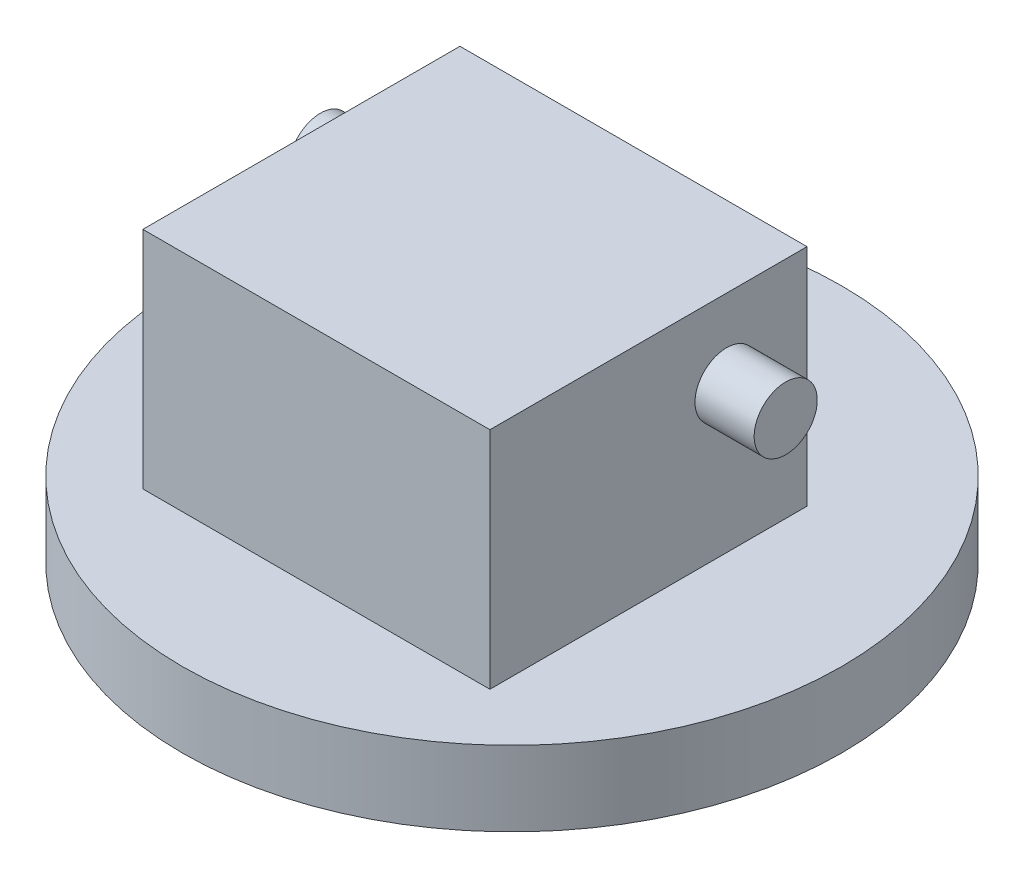
ISO-10303-21;
HEADER;
FILE_DESCRIPTION(('STEP AP214'),'2;1');
FILE_NAME('part.step','',(''),(''),'','','');
FILE_SCHEMA(('AUTOMOTIVE_DESIGN { 1 0 10303 214 1 1 1 1 }'));
ENDSEC;
DATA;
#1=APPLICATION_CONTEXT('core data for automotive mechanical design processes');
#2=APPLICATION_PROTOCOL_DEFINITION('international standard','automotive_design',2000,#1);
#3=PRODUCT_CONTEXT('',#1,'mechanical');
#4=PRODUCT('Part','Part','',(#3));
#5=PRODUCT_RELATED_PRODUCT_CATEGORY('part','',(#4));
#6=PRODUCT_DEFINITION_FORMATION('','',#4);
#7=PRODUCT_DEFINITION_CONTEXT('part definition',#1,'design');
#8=PRODUCT_DEFINITION('design','',#6,#7);
#9=PRODUCT_DEFINITION_SHAPE('','',#8);
#10=(LENGTH_UNIT() NAMED_UNIT(*) SI_UNIT(.MILLI.,.METRE.));
#11=(NAMED_UNIT(*) PLANE_ANGLE_UNIT() SI_UNIT($,.RADIAN.));
#12=(NAMED_UNIT(*) SI_UNIT($,.STERADIAN.) SOLID_ANGLE_UNIT());
#13=UNCERTAINTY_MEASURE_WITH_UNIT(LENGTH_MEASURE(1.E-05),#10,'distance_accuracy_value','');
#14=(GEOMETRIC_REPRESENTATION_CONTEXT(3) GLOBAL_UNCERTAINTY_ASSIGNED_CONTEXT((#13)) GLOBAL_UNIT_ASSIGNED_CONTEXT((#10,
#11,#12)) REPRESENTATION_CONTEXT('',''));
#15=CARTESIAN_POINT('',(0.,0.,0.));
#16=DIRECTION('',(0.,0.,1.));
#17=DIRECTION('',(1.,0.,0.));
#18=AXIS2_PLACEMENT_3D('',#15,#16,#17);
#19=CARTESIAN_POINT('',(0.,9.5,0.));
#20=DIRECTION('',(0.,1.,0.));
#21=DIRECTION('',(0.,0.,1.));
#22=AXIS2_PLACEMENT_3D('',#19,#20,#21);
#23=PLANE('',#22);
#24=CARTESIAN_POINT('',(0.,9.5,0.));
#25=DIRECTION('',(0.,1.,0.));
#26=DIRECTION('',(0.,0.,1.));
#27=AXIS2_PLACEMENT_3D('',#24,#25,#26);
#28=CIRCLE('',#27,41.8);
#29=CARTESIAN_POINT('',(0.,9.5,41.8));
#30=VERTEX_POINT('',#29);
#31=EDGE_CURVE('E11',#30,#30,#28,.T.);
#32=ORIENTED_EDGE('',*,*,#31,.T.);
#33=EDGE_LOOP('',(#32));
#34=FACE_BOUND('',#33,.T.);
#35=DIRECTION('',(1.,0.,0.));
#36=VECTOR('',#35,1.);
#37=CARTESIAN_POINT('',(0.,9.5,-15.4));
#38=LINE('',#37,#36);
#39=CARTESIAN_POINT('',(-22.,9.5,-15.4));
#40=VERTEX_POINT('',#39);
#41=CARTESIAN_POINT('',(22.,9.5,-15.4));
#42=VERTEX_POINT('',#41);
#43=EDGE_CURVE('E95',#40,#42,#38,.T.);
#44=ORIENTED_EDGE('',*,*,#43,.T.);
#45=DIRECTION('',(0.,0.,1.));
#46=VECTOR('',#45,1.);
#47=CARTESIAN_POINT('',(22.,9.5,0.));
#48=LINE('',#47,#46);
#49=CARTESIAN_POINT('',(22.,9.5,24.8));
#50=VERTEX_POINT('',#49);
#51=EDGE_CURVE('E60',#42,#50,#48,.T.);
#52=ORIENTED_EDGE('',*,*,#51,.T.);
#53=DIRECTION('',(-1.,0.,0.));
#54=VECTOR('',#53,1.);
#55=CARTESIAN_POINT('',(0.,9.5,24.8));
#56=LINE('',#55,#54);
#57=CARTESIAN_POINT('',(-22.,9.5,24.8));
#58=VERTEX_POINT('',#57);
#59=EDGE_CURVE('E111',#50,#58,#56,.T.);
#60=ORIENTED_EDGE('',*,*,#59,.T.);
#61=DIRECTION('',(0.,0.,1.));
#62=VECTOR('',#61,1.);
#63=CARTESIAN_POINT('',(-22.,9.5,0.));
#64=LINE('',#63,#62);
#65=EDGE_CURVE('E119',#40,#58,#64,.T.);
#66=ORIENTED_EDGE('',*,*,#65,.F.);
#67=EDGE_LOOP('',(#44,#52,#60,#66));
#68=FACE_BOUND('',#67,.T.);
#69=ADVANCED_FACE('F45',(#34,#68),#23,.T.);
#70=CARTESIAN_POINT('',(0.,9.5,0.));
#71=DIRECTION('',(0.,-1.,0.));
#72=DIRECTION('',(0.,0.,-1.));
#73=AXIS2_PLACEMENT_3D('',#70,#71,#72);
#74=CYLINDRICAL_SURFACE('',#73,41.8);
#75=ORIENTED_EDGE('',*,*,#31,.F.);
#76=EDGE_LOOP('',(#75));
#77=FACE_BOUND('',#76,.T.);
#78=CARTESIAN_POINT('',(0.,0.,0.));
#79=DIRECTION('',(0.,1.,0.));
#80=DIRECTION('',(0.,0.,1.));
#81=AXIS2_PLACEMENT_3D('',#78,#79,#80);
#82=CIRCLE('',#81,41.8);
#83=CARTESIAN_POINT('',(0.,0.,41.8));
#84=VERTEX_POINT('',#83);
#85=EDGE_CURVE('E49',#84,#84,#82,.T.);
#86=ORIENTED_EDGE('',*,*,#85,.T.);
#87=EDGE_LOOP('',(#86));
#88=FACE_BOUND('',#87,.T.);
#89=ADVANCED_FACE('F47',(#77,#88),#74,.T.);
#90=CARTESIAN_POINT('',(0.,0.,0.));
#91=DIRECTION('',(0.,1.,0.));
#92=DIRECTION('',(0.,0.,1.));
#93=AXIS2_PLACEMENT_3D('',#90,#91,#92);
#94=PLANE('',#93);
#95=ORIENTED_EDGE('',*,*,#85,.F.);
#96=EDGE_LOOP('',(#95));
#97=FACE_BOUND('',#96,.T.);
#98=ADVANCED_FACE('F129',(#97),#94,.F.);
#99=CARTESIAN_POINT('',(22.,38.,0.));
#100=DIRECTION('',(1.,0.,0.));
#101=DIRECTION('',(0.,0.,-1.));
#102=AXIS2_PLACEMENT_3D('',#99,#100,#101);
#103=PLANE('',#102);
#104=CARTESIAN_POINT('',(22.,28.,-5.20000000000001));
#105=DIRECTION('',(1.,0.,0.));
#106=DIRECTION('',(0.,0.,-1.));
#107=AXIS2_PLACEMENT_3D('',#104,#105,#106);
#108=CIRCLE('',#107,4.);
#109=CARTESIAN_POINT('',(22.,28.,-9.20000000000001));
#110=VERTEX_POINT('',#109);
#111=EDGE_CURVE('E176',#110,#110,#108,.T.);
#112=ORIENTED_EDGE('',*,*,#111,.F.);
#113=EDGE_LOOP('',(#112));
#114=FACE_BOUND('',#113,.T.);
#115=ORIENTED_EDGE('',*,*,#51,.F.);
#116=DIRECTION('',(0.,-1.,0.));
#117=VECTOR('',#116,1.);
#118=CARTESIAN_POINT('',(22.,38.,-15.4));
#119=LINE('',#118,#117);
#120=CARTESIAN_POINT('',(22.,38.,-15.4));
#121=VERTEX_POINT('',#120);
#122=EDGE_CURVE('E83',#121,#42,#119,.T.);
#123=ORIENTED_EDGE('',*,*,#122,.F.);
#124=DIRECTION('',(0.,0.,1.));
#125=VECTOR('',#124,1.);
#126=CARTESIAN_POINT('',(22.,38.,0.));
#127=LINE('',#126,#125);
#128=CARTESIAN_POINT('',(22.,38.,24.8));
#129=VERTEX_POINT('',#128);
#130=EDGE_CURVE('E109',#121,#129,#127,.T.);
#131=ORIENTED_EDGE('',*,*,#130,.T.);
#132=DIRECTION('',(0.,-1.,0.));
#133=VECTOR('',#132,1.);
#134=CARTESIAN_POINT('',(22.,38.,24.8));
#135=LINE('',#134,#133);
#136=EDGE_CURVE('E68',#129,#50,#135,.T.);
#137=ORIENTED_EDGE('',*,*,#136,.T.);
#138=EDGE_LOOP('',(#115,#123,#131,#137));
#139=FACE_BOUND('',#138,.T.);
#140=ADVANCED_FACE('F131',(#114,#139),#103,.T.);
#141=CARTESIAN_POINT('',(0.,38.,-15.4));
#142=DIRECTION('',(0.,0.,-1.));
#143=DIRECTION('',(-1.,0.,0.));
#144=AXIS2_PLACEMENT_3D('',#141,#142,#143);
#145=PLANE('',#144);
#146=ORIENTED_EDGE('',*,*,#43,.F.);
#147=DIRECTION('',(0.,-1.,0.));
#148=VECTOR('',#147,1.);
#149=CARTESIAN_POINT('',(-22.,38.,-15.4));
#150=LINE('',#149,#148);
#151=CARTESIAN_POINT('',(-22.,38.,-15.4));
#152=VERTEX_POINT('',#151);
#153=EDGE_CURVE('E89',#152,#40,#150,.T.);
#154=ORIENTED_EDGE('',*,*,#153,.F.);
#155=DIRECTION('',(1.,0.,0.));
#156=VECTOR('',#155,1.);
#157=CARTESIAN_POINT('',(0.,38.,-15.4));
#158=LINE('',#157,#156);
#159=EDGE_CURVE('E93',#152,#121,#158,.T.);
#160=ORIENTED_EDGE('',*,*,#159,.T.);
#161=ORIENTED_EDGE('',*,*,#122,.T.);
#162=EDGE_LOOP('',(#146,#154,#160,#161));
#163=FACE_BOUND('',#162,.T.);
#164=ADVANCED_FACE('F91',(#163),#145,.T.);
#165=CARTESIAN_POINT('',(-22.,38.,0.));
#166=DIRECTION('',(1.,0.,0.));
#167=DIRECTION('',(0.,0.,-1.));
#168=AXIS2_PLACEMENT_3D('',#165,#166,#167);
#169=PLANE('',#168);
#170=CARTESIAN_POINT('',(-22.,28.,-5.20000000000001));
#171=DIRECTION('',(1.,0.,0.));
#172=DIRECTION('',(0.,0.,-1.));
#173=AXIS2_PLACEMENT_3D('',#170,#171,#172);
#174=CIRCLE('',#173,4.);
#175=CARTESIAN_POINT('',(-22.,28.,-9.20000000000001));
#176=VERTEX_POINT('',#175);
#177=EDGE_CURVE('E177',#176,#176,#174,.T.);
#178=ORIENTED_EDGE('',*,*,#177,.T.);
#179=EDGE_LOOP('',(#178));
#180=FACE_BOUND('',#179,.T.);
#181=ORIENTED_EDGE('',*,*,#65,.T.);
#182=DIRECTION('',(0.,-1.,0.));
#183=VECTOR('',#182,1.);
#184=CARTESIAN_POINT('',(-22.,38.,24.8));
#185=LINE('',#184,#183);
#186=CARTESIAN_POINT('',(-22.,38.,24.8));
#187=VERTEX_POINT('',#186);
#188=EDGE_CURVE('E99',#187,#58,#185,.T.);
#189=ORIENTED_EDGE('',*,*,#188,.F.);
#190=DIRECTION('',(0.,0.,1.));
#191=VECTOR('',#190,1.);
#192=CARTESIAN_POINT('',(-22.,38.,0.));
#193=LINE('',#192,#191);
#194=EDGE_CURVE('E102',#152,#187,#193,.T.);
#195=ORIENTED_EDGE('',*,*,#194,.F.);
#196=ORIENTED_EDGE('',*,*,#153,.T.);
#197=EDGE_LOOP('',(#181,#189,#195,#196));
#198=FACE_BOUND('',#197,.T.);
#199=ADVANCED_FACE('F103',(#180,#198),#169,.F.);
#200=CARTESIAN_POINT('',(0.,38.,24.8));
#201=DIRECTION('',(0.,0.,1.));
#202=DIRECTION('',(1.,0.,0.));
#203=AXIS2_PLACEMENT_3D('',#200,#201,#202);
#204=PLANE('',#203);
#205=ORIENTED_EDGE('',*,*,#59,.F.);
#206=ORIENTED_EDGE('',*,*,#136,.F.);
#207=DIRECTION('',(-1.,0.,0.));
#208=VECTOR('',#207,1.);
#209=CARTESIAN_POINT('',(0.,38.,24.8));
#210=LINE('',#209,#208);
#211=EDGE_CURVE('E106',#129,#187,#210,.T.);
#212=ORIENTED_EDGE('',*,*,#211,.T.);
#213=ORIENTED_EDGE('',*,*,#188,.T.);
#214=EDGE_LOOP('',(#205,#206,#212,#213));
#215=FACE_BOUND('',#214,.T.);
#216=ADVANCED_FACE('F150',(#215),#204,.T.);
#217=CARTESIAN_POINT('',(0.,38.,0.));
#218=DIRECTION('',(0.,1.,0.));
#219=DIRECTION('',(0.,0.,1.));
#220=AXIS2_PLACEMENT_3D('',#217,#218,#219);
#221=PLANE('',#220);
#222=ORIENTED_EDGE('',*,*,#130,.F.);
#223=ORIENTED_EDGE('',*,*,#159,.F.);
#224=ORIENTED_EDGE('',*,*,#194,.T.);
#225=ORIENTED_EDGE('',*,*,#211,.F.);
#226=EDGE_LOOP('',(#222,#223,#224,#225));
#227=FACE_BOUND('',#226,.T.);
#228=ADVANCED_FACE('F108',(#227),#221,.T.);
#229=CARTESIAN_POINT('',(29.5,28.,-5.20000000000001));
#230=DIRECTION('',(-1.,0.,0.));
#231=DIRECTION('',(0.,0.,1.));
#232=AXIS2_PLACEMENT_3D('',#229,#230,#231);
#233=CYLINDRICAL_SURFACE('',#232,4.);
#234=CARTESIAN_POINT('',(29.5,28.,-5.20000000000001));
#235=DIRECTION('',(1.,0.,0.));
#236=DIRECTION('',(0.,0.,-1.));
#237=AXIS2_PLACEMENT_3D('',#234,#235,#236);
#238=CIRCLE('',#237,4.);
#239=CARTESIAN_POINT('',(29.5,28.,-9.20000000000001));
#240=VERTEX_POINT('',#239);
#241=EDGE_CURVE('E117',#240,#240,#238,.T.);
#242=ORIENTED_EDGE('',*,*,#241,.F.);
#243=EDGE_LOOP('',(#242));
#244=FACE_BOUND('',#243,.T.);
#245=ORIENTED_EDGE('',*,*,#111,.T.);
#246=EDGE_LOOP('',(#245));
#247=FACE_BOUND('',#246,.T.);
#248=ADVANCED_FACE('F156',(#244,#247),#233,.T.);
#249=CARTESIAN_POINT('',(29.5,28.,-5.20000000000001));
#250=DIRECTION('',(1.,0.,0.));
#251=DIRECTION('',(0.,0.,-1.));
#252=AXIS2_PLACEMENT_3D('',#249,#250,#251);
#253=PLANE('',#252);
#254=ORIENTED_EDGE('',*,*,#241,.T.);
#255=EDGE_LOOP('',(#254));
#256=FACE_BOUND('',#255,.T.);
#257=ADVANCED_FACE('F159',(#256),#253,.T.);
#258=CARTESIAN_POINT('',(-29.5,28.,-5.20000000000001));
#259=DIRECTION('',(1.,0.,0.));
#260=DIRECTION('',(0.,0.,-1.));
#261=AXIS2_PLACEMENT_3D('',#258,#259,#260);
#262=CYLINDRICAL_SURFACE('',#261,4.);
#263=CARTESIAN_POINT('',(-29.5,28.,-5.20000000000001));
#264=DIRECTION('',(1.,0.,0.));
#265=DIRECTION('',(0.,0.,-1.));
#266=AXIS2_PLACEMENT_3D('',#263,#264,#265);
#267=CIRCLE('',#266,4.);
#268=CARTESIAN_POINT('',(-29.5,28.,-9.20000000000001));
#269=VERTEX_POINT('',#268);
#270=EDGE_CURVE('E175',#269,#269,#267,.T.);
#271=ORIENTED_EDGE('',*,*,#270,.T.);
#272=EDGE_LOOP('',(#271));
#273=FACE_BOUND('',#272,.T.);
#274=ORIENTED_EDGE('',*,*,#177,.F.);
#275=EDGE_LOOP('',(#274));
#276=FACE_BOUND('',#275,.T.);
#277=ADVANCED_FACE('F163',(#273,#276),#262,.T.);
#278=CARTESIAN_POINT('',(-29.5,28.,-5.20000000000001));
#279=DIRECTION('',(-1.,0.,0.));
#280=DIRECTION('',(0.,0.,-1.));
#281=AXIS2_PLACEMENT_3D('',#278,#279,#280);
#282=PLANE('',#281);
#283=ORIENTED_EDGE('',*,*,#270,.F.);
#284=EDGE_LOOP('',(#283));
#285=FACE_BOUND('',#284,.T.);
#286=ADVANCED_FACE('F167',(#285),#282,.T.);
#287=CLOSED_SHELL('',(#69,#89,#98,#140,#164,#199,#216,#228,#248,#257,#277,#286));
#288=MANIFOLD_SOLID_BREP('B2',#287);
#289=ADVANCED_BREP_SHAPE_REPRESENTATION('',(#18,#288),#14);
#290=SHAPE_DEFINITION_REPRESENTATION(#9,#289);
ENDSEC;
END-ISO-10303-21;
